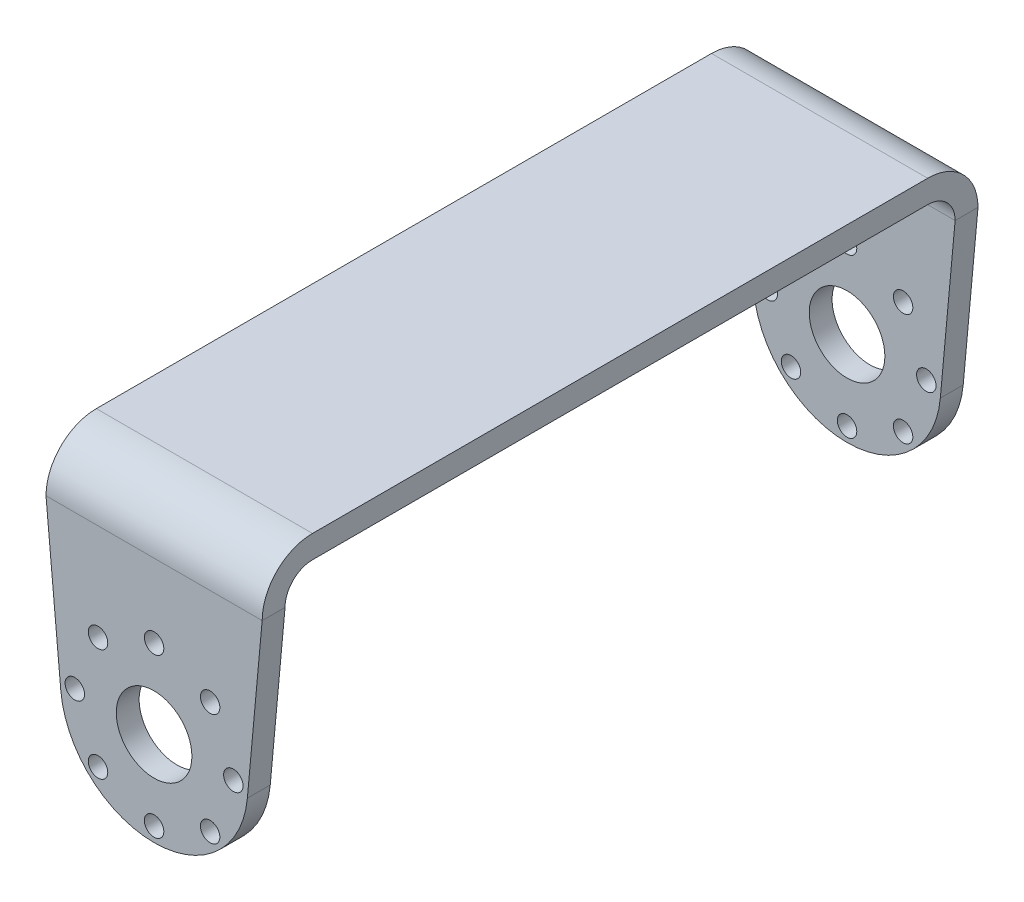
ISO-10303-21;
HEADER;
FILE_DESCRIPTION(('STEP AP214'),'2;1');
FILE_NAME('part.step','',(''),(''),'','','');
FILE_SCHEMA(('AUTOMOTIVE_DESIGN { 1 0 10303 214 1 1 1 1 }'));
ENDSEC;
DATA;
#1=APPLICATION_CONTEXT('core data for automotive mechanical design processes');
#2=APPLICATION_PROTOCOL_DEFINITION('international standard','automotive_design',2000,#1);
#3=PRODUCT_CONTEXT('',#1,'mechanical');
#4=PRODUCT('Part','Part','',(#3));
#5=PRODUCT_RELATED_PRODUCT_CATEGORY('part','',(#4));
#6=PRODUCT_DEFINITION_FORMATION('','',#4);
#7=PRODUCT_DEFINITION_CONTEXT('part definition',#1,'design');
#8=PRODUCT_DEFINITION('design','',#6,#7);
#9=PRODUCT_DEFINITION_SHAPE('','',#8);
#10=(LENGTH_UNIT() NAMED_UNIT(*) SI_UNIT(.MILLI.,.METRE.));
#11=(NAMED_UNIT(*) PLANE_ANGLE_UNIT() SI_UNIT($,.RADIAN.));
#12=(NAMED_UNIT(*) SI_UNIT($,.STERADIAN.) SOLID_ANGLE_UNIT());
#13=UNCERTAINTY_MEASURE_WITH_UNIT(LENGTH_MEASURE(1.E-05),#10,'distance_accuracy_value','');
#14=(GEOMETRIC_REPRESENTATION_CONTEXT(3) GLOBAL_UNCERTAINTY_ASSIGNED_CONTEXT((#13)) GLOBAL_UNIT_ASSIGNED_CONTEXT((#10,
#11,#12)) REPRESENTATION_CONTEXT('',''));
#15=CARTESIAN_POINT('',(0.,0.,0.));
#16=DIRECTION('',(0.,0.,1.));
#17=DIRECTION('',(1.,0.,0.));
#18=AXIS2_PLACEMENT_3D('',#15,#16,#17);
#19=CARTESIAN_POINT('',(0.,1.7241473651667E-13,49.675));
#20=DIRECTION('',(0.,0.,-1.));
#21=DIRECTION('',(0.,1.,0.));
#22=AXIS2_PLACEMENT_3D('',#19,#20,#21);
#23=PLANE('',#22);
#24=CARTESIAN_POINT('',(7.77817459305203,-17.221825406948,49.6750000000001));
#25=DIRECTION('',(0.,0.,1.));
#26=DIRECTION('',(1.,0.,0.));
#27=AXIS2_PLACEMENT_3D('',#24,#25,#26);
#28=CIRCLE('',#27,1.35);
#29=CARTESIAN_POINT('',(9.12817459305203,-17.221825406948,49.6750000000001));
#30=VERTEX_POINT('',#29);
#31=EDGE_CURVE('E194',#30,#30,#28,.T.);
#32=ORIENTED_EDGE('',*,*,#31,.F.);
#33=EDGE_LOOP('',(#32));
#34=FACE_BOUND('',#33,.T.);
#35=CARTESIAN_POINT('',(11.,-25.,49.6750000000001));
#36=DIRECTION('',(0.,0.,1.));
#37=DIRECTION('',(1.,0.,0.));
#38=AXIS2_PLACEMENT_3D('',#35,#36,#37);
#39=CIRCLE('',#38,1.35);
#40=CARTESIAN_POINT('',(12.35,-25.,49.6750000000001));
#41=VERTEX_POINT('',#40);
#42=EDGE_CURVE('E187',#41,#41,#39,.T.);
#43=ORIENTED_EDGE('',*,*,#42,.F.);
#44=EDGE_LOOP('',(#43));
#45=FACE_BOUND('',#44,.T.);
#46=CARTESIAN_POINT('',(7.77817459305203,-32.778174593052,49.6750000000001));
#47=DIRECTION('',(0.,0.,1.));
#48=DIRECTION('',(1.,0.,0.));
#49=AXIS2_PLACEMENT_3D('',#46,#47,#48);
#50=CIRCLE('',#49,1.35);
#51=CARTESIAN_POINT('',(9.12817459305203,-32.778174593052,49.6750000000001));
#52=VERTEX_POINT('',#51);
#53=EDGE_CURVE('E178',#52,#52,#50,.T.);
#54=ORIENTED_EDGE('',*,*,#53,.F.);
#55=EDGE_LOOP('',(#54));
#56=FACE_BOUND('',#55,.T.);
#57=CARTESIAN_POINT('',(0.,-25.,49.6750000000001));
#58=DIRECTION('',(0.,0.,1.));
#59=DIRECTION('',(1.,0.,0.));
#60=AXIS2_PLACEMENT_3D('',#57,#58,#59);
#61=CIRCLE('',#60,5.25);
#62=CARTESIAN_POINT('',(5.25,-25.,49.6750000000001));
#63=VERTEX_POINT('',#62);
#64=EDGE_CURVE('E173',#63,#63,#61,.T.);
#65=ORIENTED_EDGE('',*,*,#64,.F.);
#66=EDGE_LOOP('',(#65));
#67=FACE_BOUND('',#66,.T.);
#68=CARTESIAN_POINT('',(0.,-14.,49.6750000000001));
#69=DIRECTION('',(0.,0.,1.));
#70=DIRECTION('',(1.,0.,0.));
#71=AXIS2_PLACEMENT_3D('',#68,#69,#70);
#72=CIRCLE('',#71,1.35);
#73=CARTESIAN_POINT('',(1.35,-14.,49.6750000000001));
#74=VERTEX_POINT('',#73);
#75=EDGE_CURVE('E203',#74,#74,#72,.T.);
#76=ORIENTED_EDGE('',*,*,#75,.F.);
#77=EDGE_LOOP('',(#76));
#78=FACE_BOUND('',#77,.T.);
#79=CARTESIAN_POINT('',(-7.77817459305202,-17.221825406948,49.6750000000001));
#80=DIRECTION('',(0.,0.,1.));
#81=DIRECTION('',(1.,0.,0.));
#82=AXIS2_PLACEMENT_3D('',#79,#80,#81);
#83=CIRCLE('',#82,1.35);
#84=CARTESIAN_POINT('',(-6.42817459305202,-17.221825406948,49.6750000000001));
#85=VERTEX_POINT('',#84);
#86=EDGE_CURVE('E228',#85,#85,#83,.T.);
#87=ORIENTED_EDGE('',*,*,#86,.F.);
#88=EDGE_LOOP('',(#87));
#89=FACE_BOUND('',#88,.T.);
#90=CARTESIAN_POINT('',(-11.,-25.,49.6750000000001));
#91=DIRECTION('',(0.,0.,1.));
#92=DIRECTION('',(1.,0.,0.));
#93=AXIS2_PLACEMENT_3D('',#90,#91,#92);
#94=CIRCLE('',#93,1.35);
#95=CARTESIAN_POINT('',(-9.65,-25.,49.6750000000001));
#96=VERTEX_POINT('',#95);
#97=EDGE_CURVE('E220',#96,#96,#94,.T.);
#98=ORIENTED_EDGE('',*,*,#97,.F.);
#99=EDGE_LOOP('',(#98));
#100=FACE_BOUND('',#99,.T.);
#101=CARTESIAN_POINT('',(-7.77817459305202,-32.778174593052,49.6750000000001));
#102=DIRECTION('',(0.,0.,1.));
#103=DIRECTION('',(1.,0.,0.));
#104=AXIS2_PLACEMENT_3D('',#101,#102,#103);
#105=CIRCLE('',#104,1.35);
#106=CARTESIAN_POINT('',(-6.42817459305202,-32.778174593052,49.6750000000001));
#107=VERTEX_POINT('',#106);
#108=EDGE_CURVE('E210',#107,#107,#105,.T.);
#109=ORIENTED_EDGE('',*,*,#108,.F.);
#110=EDGE_LOOP('',(#109));
#111=FACE_BOUND('',#110,.T.);
#112=CARTESIAN_POINT('',(0.,-36.,49.6750000000001));
#113=DIRECTION('',(0.,0.,1.));
#114=DIRECTION('',(1.,0.,0.));
#115=AXIS2_PLACEMENT_3D('',#112,#113,#114);
#116=CIRCLE('',#115,1.35);
#117=CARTESIAN_POINT('',(1.35,-36.,49.6750000000001));
#118=VERTEX_POINT('',#117);
#119=EDGE_CURVE('E219',#118,#118,#116,.T.);
#120=ORIENTED_EDGE('',*,*,#119,.F.);
#121=EDGE_LOOP('',(#120));
#122=FACE_BOUND('',#121,.T.);
#123=DIRECTION('',(0.09141984750114,-0.995812437903277,0.));
#124=VECTOR('',#123,1.);
#125=CARTESIAN_POINT('',(-12.9455616927426,-26.1884580175148,49.6750000000001));
#126=LINE('',#125,#124);
#127=CARTESIAN_POINT('',(-15.,-3.80999999999999,49.6750000000001));
#128=VERTEX_POINT('',#127);
#129=CARTESIAN_POINT('',(-12.9455616927426,-26.1884580175148,49.6750000000001));
#130=VERTEX_POINT('',#129);
#131=EDGE_CURVE('E151',#128,#130,#126,.T.);
#132=ORIENTED_EDGE('',*,*,#131,.T.);
#133=CARTESIAN_POINT('',(0.,-25.,49.6750000000001));
#134=DIRECTION('',(0.,0.,1.));
#135=DIRECTION('',(1.,0.,0.));
#136=AXIS2_PLACEMENT_3D('',#133,#134,#135);
#137=CIRCLE('',#136,13.);
#138=CARTESIAN_POINT('',(12.9455616927426,-26.1884580175148,49.6750000000001));
#139=VERTEX_POINT('',#138);
#140=EDGE_CURVE('E134',#130,#139,#137,.T.);
#141=ORIENTED_EDGE('',*,*,#140,.T.);
#142=DIRECTION('',(0.0914198475011396,0.995812437903277,0.));
#143=VECTOR('',#142,1.);
#144=CARTESIAN_POINT('',(12.9455616927426,-26.1884580175148,49.6750000000001));
#145=LINE('',#144,#143);
#146=CARTESIAN_POINT('',(15.,-3.80999999999996,49.6750000000001));
#147=VERTEX_POINT('',#146);
#148=EDGE_CURVE('E143',#139,#147,#145,.T.);
#149=ORIENTED_EDGE('',*,*,#148,.T.);
#150=DIRECTION('',(1.,0.,0.));
#151=VECTOR('',#150,1.);
#152=CARTESIAN_POINT('',(0.,-3.80999999999999,49.675));
#153=LINE('',#152,#151);
#154=EDGE_CURVE('E347',#128,#147,#153,.T.);
#155=ORIENTED_EDGE('',*,*,#154,.F.);
#156=EDGE_LOOP('',(#132,#141,#149,#155));
#157=FACE_BOUND('',#156,.T.);
#158=ADVANCED_FACE('F41',(#34,#45,#56,#67,#78,#89,#100,#111,#122,#157),#23,.F.);
#159=CARTESIAN_POINT('',(0.,1.61329283265843E-13,46.5));
#160=DIRECTION('',(0.,0.,-1.));
#161=DIRECTION('',(0.,1.,0.));
#162=AXIS2_PLACEMENT_3D('',#159,#160,#161);
#163=PLANE('',#162);
#164=CARTESIAN_POINT('',(7.77817459305203,-17.221825406948,46.5000000000001));
#165=DIRECTION('',(0.,0.,-1.));
#166=DIRECTION('',(0.,1.,0.));
#167=AXIS2_PLACEMENT_3D('',#164,#165,#166);
#168=CIRCLE('',#167,1.35);
#169=CARTESIAN_POINT('',(7.77817459305203,-15.871825406948,46.5000000000001));
#170=VERTEX_POINT('',#169);
#171=EDGE_CURVE('E299',#170,#170,#168,.T.);
#172=ORIENTED_EDGE('',*,*,#171,.F.);
#173=EDGE_LOOP('',(#172));
#174=FACE_BOUND('',#173,.T.);
#175=CARTESIAN_POINT('',(11.,-25.,46.5000000000001));
#176=DIRECTION('',(0.,0.,-1.));
#177=DIRECTION('',(0.,1.,0.));
#178=AXIS2_PLACEMENT_3D('',#175,#176,#177);
#179=CIRCLE('',#178,1.35);
#180=CARTESIAN_POINT('',(11.,-23.65,46.5000000000001));
#181=VERTEX_POINT('',#180);
#182=EDGE_CURVE('E295',#181,#181,#179,.T.);
#183=ORIENTED_EDGE('',*,*,#182,.F.);
#184=EDGE_LOOP('',(#183));
#185=FACE_BOUND('',#184,.T.);
#186=CARTESIAN_POINT('',(7.77817459305203,-32.778174593052,46.5000000000001));
#187=DIRECTION('',(0.,0.,-1.));
#188=DIRECTION('',(0.,1.,0.));
#189=AXIS2_PLACEMENT_3D('',#186,#187,#188);
#190=CIRCLE('',#189,1.35);
#191=CARTESIAN_POINT('',(7.77817459305203,-31.428174593052,46.5000000000001));
#192=VERTEX_POINT('',#191);
#193=EDGE_CURVE('E290',#192,#192,#190,.T.);
#194=ORIENTED_EDGE('',*,*,#193,.F.);
#195=EDGE_LOOP('',(#194));
#196=FACE_BOUND('',#195,.T.);
#197=CARTESIAN_POINT('',(0.,-25.,46.5000000000001));
#198=DIRECTION('',(0.,0.,-1.));
#199=DIRECTION('',(0.,1.,0.));
#200=AXIS2_PLACEMENT_3D('',#197,#198,#199);
#201=CIRCLE('',#200,5.25);
#202=CARTESIAN_POINT('',(0.,-19.75,46.5000000000001));
#203=VERTEX_POINT('',#202);
#204=EDGE_CURVE('E285',#203,#203,#201,.T.);
#205=ORIENTED_EDGE('',*,*,#204,.F.);
#206=EDGE_LOOP('',(#205));
#207=FACE_BOUND('',#206,.T.);
#208=CARTESIAN_POINT('',(0.,-14.,46.5000000000001));
#209=DIRECTION('',(0.,0.,-1.));
#210=DIRECTION('',(0.,1.,0.));
#211=AXIS2_PLACEMENT_3D('',#208,#209,#210);
#212=CIRCLE('',#211,1.35);
#213=CARTESIAN_POINT('',(0.,-12.65,46.5000000000001));
#214=VERTEX_POINT('',#213);
#215=EDGE_CURVE('E280',#214,#214,#212,.T.);
#216=ORIENTED_EDGE('',*,*,#215,.F.);
#217=EDGE_LOOP('',(#216));
#218=FACE_BOUND('',#217,.T.);
#219=CARTESIAN_POINT('',(-7.77817459305202,-17.221825406948,46.5000000000001));
#220=DIRECTION('',(0.,0.,-1.));
#221=DIRECTION('',(0.,1.,0.));
#222=AXIS2_PLACEMENT_3D('',#219,#220,#221);
#223=CIRCLE('',#222,1.35);
#224=CARTESIAN_POINT('',(-7.77817459305202,-15.871825406948,46.5000000000001));
#225=VERTEX_POINT('',#224);
#226=EDGE_CURVE('E276',#225,#225,#223,.T.);
#227=ORIENTED_EDGE('',*,*,#226,.F.);
#228=EDGE_LOOP('',(#227));
#229=FACE_BOUND('',#228,.T.);
#230=CARTESIAN_POINT('',(-11.,-25.,46.5000000000001));
#231=DIRECTION('',(0.,0.,-1.));
#232=DIRECTION('',(0.,1.,0.));
#233=AXIS2_PLACEMENT_3D('',#230,#231,#232);
#234=CIRCLE('',#233,1.35);
#235=CARTESIAN_POINT('',(-11.,-23.65,46.5000000000001));
#236=VERTEX_POINT('',#235);
#237=EDGE_CURVE('E271',#236,#236,#234,.T.);
#238=ORIENTED_EDGE('',*,*,#237,.F.);
#239=EDGE_LOOP('',(#238));
#240=FACE_BOUND('',#239,.T.);
#241=CARTESIAN_POINT('',(-7.77817459305202,-32.778174593052,46.5000000000001));
#242=DIRECTION('',(0.,0.,-1.));
#243=DIRECTION('',(0.,1.,0.));
#244=AXIS2_PLACEMENT_3D('',#241,#242,#243);
#245=CIRCLE('',#244,1.35);
#246=CARTESIAN_POINT('',(-7.77817459305202,-31.428174593052,46.5000000000001));
#247=VERTEX_POINT('',#246);
#248=EDGE_CURVE('E266',#247,#247,#245,.T.);
#249=ORIENTED_EDGE('',*,*,#248,.F.);
#250=EDGE_LOOP('',(#249));
#251=FACE_BOUND('',#250,.T.);
#252=CARTESIAN_POINT('',(0.,-36.,46.5000000000001));
#253=DIRECTION('',(0.,0.,-1.));
#254=DIRECTION('',(0.,1.,0.));
#255=AXIS2_PLACEMENT_3D('',#252,#253,#254);
#256=CIRCLE('',#255,1.35);
#257=CARTESIAN_POINT('',(0.,-34.65,46.5000000000001));
#258=VERTEX_POINT('',#257);
#259=EDGE_CURVE('E254',#258,#258,#256,.T.);
#260=ORIENTED_EDGE('',*,*,#259,.F.);
#261=EDGE_LOOP('',(#260));
#262=FACE_BOUND('',#261,.T.);
#263=CARTESIAN_POINT('',(0.,-25.,46.5000000000001));
#264=DIRECTION('',(0.,0.,-1.));
#265=DIRECTION('',(0.,1.,0.));
#266=AXIS2_PLACEMENT_3D('',#263,#264,#265);
#267=CIRCLE('',#266,13.);
#268=CARTESIAN_POINT('',(12.9455616927426,-26.1884580175148,46.5000000000001));
#269=VERTEX_POINT('',#268);
#270=CARTESIAN_POINT('',(-12.9455616927426,-26.1884580175148,46.5000000000001));
#271=VERTEX_POINT('',#270);
#272=EDGE_CURVE('E136',#269,#271,#267,.T.);
#273=ORIENTED_EDGE('',*,*,#272,.T.);
#274=DIRECTION('',(-0.09141984750114,0.995812437903277,0.));
#275=VECTOR('',#274,1.);
#276=CARTESIAN_POINT('',(-15.221487223064,-1.39739773044295,46.5));
#277=LINE('',#276,#275);
#278=CARTESIAN_POINT('',(-15.,-3.80999999999999,46.5000000000001));
#279=VERTEX_POINT('',#278);
#280=EDGE_CURVE('E261',#271,#279,#277,.T.);
#281=ORIENTED_EDGE('',*,*,#280,.T.);
#282=DIRECTION('',(-1.,0.,0.));
#283=VECTOR('',#282,1.);
#284=CARTESIAN_POINT('',(15.,-3.80999999999999,46.5));
#285=LINE('',#284,#283);
#286=CARTESIAN_POINT('',(15.,-3.80999999999996,46.5000000000001));
#287=VERTEX_POINT('',#286);
#288=EDGE_CURVE('E339',#287,#279,#285,.T.);
#289=ORIENTED_EDGE('',*,*,#288,.F.);
#290=DIRECTION('',(-0.0914198475011396,-0.995812437903277,0.));
#291=VECTOR('',#290,1.);
#292=CARTESIAN_POINT('',(15.221487223064,-1.39739773044294,46.5));
#293=LINE('',#292,#291);
#294=EDGE_CURVE('E258',#287,#269,#293,.T.);
#295=ORIENTED_EDGE('',*,*,#294,.T.);
#296=EDGE_LOOP('',(#273,#281,#289,#295));
#297=FACE_BOUND('',#296,.T.);
#298=ADVANCED_FACE('F483',(#174,#185,#196,#207,#218,#229,#240,#251,#262,#297),#163,.T.);
#299=CARTESIAN_POINT('',(0.,1.7241473651667E-13,-49.675));
#300=DIRECTION('',(0.,0.,1.));
#301=DIRECTION('',(0.,-1.,0.));
#302=AXIS2_PLACEMENT_3D('',#299,#300,#301);
#303=PLANE('',#302);
#304=CARTESIAN_POINT('',(7.77817459305203,-17.221825406948,-49.6750000000001));
#305=DIRECTION('',(0.,0.,1.));
#306=DIRECTION('',(1.,0.,0.));
#307=AXIS2_PLACEMENT_3D('',#304,#305,#306);
#308=CIRCLE('',#307,1.35);
#309=CARTESIAN_POINT('',(9.12817459305203,-17.221825406948,-49.6750000000001));
#310=VERTEX_POINT('',#309);
#311=EDGE_CURVE('E198',#310,#310,#308,.T.);
#312=ORIENTED_EDGE('',*,*,#311,.T.);
#313=EDGE_LOOP('',(#312));
#314=FACE_BOUND('',#313,.T.);
#315=CARTESIAN_POINT('',(11.,-25.,-49.6750000000001));
#316=DIRECTION('',(0.,0.,1.));
#317=DIRECTION('',(1.,0.,0.));
#318=AXIS2_PLACEMENT_3D('',#315,#316,#317);
#319=CIRCLE('',#318,1.35);
#320=CARTESIAN_POINT('',(12.35,-25.,-49.6750000000001));
#321=VERTEX_POINT('',#320);
#322=EDGE_CURVE('E199',#321,#321,#319,.T.);
#323=ORIENTED_EDGE('',*,*,#322,.T.);
#324=EDGE_LOOP('',(#323));
#325=FACE_BOUND('',#324,.T.);
#326=CARTESIAN_POINT('',(7.77817459305203,-32.778174593052,-49.6750000000001));
#327=DIRECTION('',(0.,0.,1.));
#328=DIRECTION('',(1.,0.,0.));
#329=AXIS2_PLACEMENT_3D('',#326,#327,#328);
#330=CIRCLE('',#329,1.35);
#331=CARTESIAN_POINT('',(9.12817459305203,-32.778174593052,-49.6750000000001));
#332=VERTEX_POINT('',#331);
#333=EDGE_CURVE('E182',#332,#332,#330,.T.);
#334=ORIENTED_EDGE('',*,*,#333,.T.);
#335=EDGE_LOOP('',(#334));
#336=FACE_BOUND('',#335,.T.);
#337=CARTESIAN_POINT('',(0.,-25.,-49.6750000000001));
#338=DIRECTION('',(0.,0.,1.));
#339=DIRECTION('',(1.,0.,0.));
#340=AXIS2_PLACEMENT_3D('',#337,#338,#339);
#341=CIRCLE('',#340,5.25);
#342=CARTESIAN_POINT('',(5.25,-25.,-49.6750000000001));
#343=VERTEX_POINT('',#342);
#344=EDGE_CURVE('E183',#343,#343,#341,.T.);
#345=ORIENTED_EDGE('',*,*,#344,.T.);
#346=EDGE_LOOP('',(#345));
#347=FACE_BOUND('',#346,.T.);
#348=CARTESIAN_POINT('',(0.,-14.,-49.6750000000001));
#349=DIRECTION('',(0.,0.,1.));
#350=DIRECTION('',(1.,0.,0.));
#351=AXIS2_PLACEMENT_3D('',#348,#349,#350);
#352=CIRCLE('',#351,1.35);
#353=CARTESIAN_POINT('',(1.35,-14.,-49.6750000000001));
#354=VERTEX_POINT('',#353);
#355=EDGE_CURVE('E232',#354,#354,#352,.T.);
#356=ORIENTED_EDGE('',*,*,#355,.T.);
#357=EDGE_LOOP('',(#356));
#358=FACE_BOUND('',#357,.T.);
#359=CARTESIAN_POINT('',(-7.77817459305202,-17.221825406948,-49.6750000000001));
#360=DIRECTION('',(0.,0.,1.));
#361=DIRECTION('',(1.,0.,0.));
#362=AXIS2_PLACEMENT_3D('',#359,#360,#361);
#363=CIRCLE('',#362,1.35);
#364=CARTESIAN_POINT('',(-6.42817459305202,-17.221825406948,-49.6750000000001));
#365=VERTEX_POINT('',#364);
#366=EDGE_CURVE('E224',#365,#365,#363,.T.);
#367=ORIENTED_EDGE('',*,*,#366,.T.);
#368=EDGE_LOOP('',(#367));
#369=FACE_BOUND('',#368,.T.);
#370=CARTESIAN_POINT('',(-11.,-25.,-49.6750000000001));
#371=DIRECTION('',(0.,0.,1.));
#372=DIRECTION('',(1.,0.,0.));
#373=AXIS2_PLACEMENT_3D('',#370,#371,#372);
#374=CIRCLE('',#373,1.35);
#375=CARTESIAN_POINT('',(-9.65,-25.,-49.6750000000001));
#376=VERTEX_POINT('',#375);
#377=EDGE_CURVE('E215',#376,#376,#374,.T.);
#378=ORIENTED_EDGE('',*,*,#377,.T.);
#379=EDGE_LOOP('',(#378));
#380=FACE_BOUND('',#379,.T.);
#381=CARTESIAN_POINT('',(-7.77817459305202,-32.778174593052,-49.6750000000001));
#382=DIRECTION('',(0.,0.,1.));
#383=DIRECTION('',(1.,0.,0.));
#384=AXIS2_PLACEMENT_3D('',#381,#382,#383);
#385=CIRCLE('',#384,1.35);
#386=CARTESIAN_POINT('',(-6.42817459305202,-32.778174593052,-49.6750000000001));
#387=VERTEX_POINT('',#386);
#388=EDGE_CURVE('E214',#387,#387,#385,.T.);
#389=ORIENTED_EDGE('',*,*,#388,.T.);
#390=EDGE_LOOP('',(#389));
#391=FACE_BOUND('',#390,.T.);
#392=CARTESIAN_POINT('',(0.,-36.,-49.6750000000001));
#393=DIRECTION('',(0.,0.,1.));
#394=DIRECTION('',(1.,0.,0.));
#395=AXIS2_PLACEMENT_3D('',#392,#393,#394);
#396=CIRCLE('',#395,1.35);
#397=CARTESIAN_POINT('',(1.35,-36.,-49.6750000000001));
#398=VERTEX_POINT('',#397);
#399=EDGE_CURVE('E244',#398,#398,#396,.T.);
#400=ORIENTED_EDGE('',*,*,#399,.T.);
#401=EDGE_LOOP('',(#400));
#402=FACE_BOUND('',#401,.T.);
#403=DIRECTION('',(0.09141984750114,-0.995812437903277,0.));
#404=VECTOR('',#403,1.);
#405=CARTESIAN_POINT('',(-12.9455616927426,-26.1884580175148,-49.6750000000001));
#406=LINE('',#405,#404);
#407=CARTESIAN_POINT('',(-15.,-3.80999999999999,-49.6750000000001));
#408=VERTEX_POINT('',#407);
#409=CARTESIAN_POINT('',(-12.9455616927426,-26.1884580175148,-49.6750000000001));
#410=VERTEX_POINT('',#409);
#411=EDGE_CURVE('E140',#408,#410,#406,.T.);
#412=ORIENTED_EDGE('',*,*,#411,.F.);
#413=DIRECTION('',(-1.,0.,0.));
#414=VECTOR('',#413,1.);
#415=CARTESIAN_POINT('',(0.,-3.80999999999996,-49.675));
#416=LINE('',#415,#414);
#417=CARTESIAN_POINT('',(15.,-3.80999999999996,-49.6750000000001));
#418=VERTEX_POINT('',#417);
#419=EDGE_CURVE('E312',#418,#408,#416,.T.);
#420=ORIENTED_EDGE('',*,*,#419,.F.);
#421=DIRECTION('',(0.0914198475011396,0.995812437903277,0.));
#422=VECTOR('',#421,1.);
#423=CARTESIAN_POINT('',(12.9455616927426,-26.1884580175148,-49.6750000000001));
#424=LINE('',#423,#422);
#425=CARTESIAN_POINT('',(12.9455616927426,-26.1884580175148,-49.6750000000001));
#426=VERTEX_POINT('',#425);
#427=EDGE_CURVE('E164',#426,#418,#424,.T.);
#428=ORIENTED_EDGE('',*,*,#427,.F.);
#429=CARTESIAN_POINT('',(0.,-25.,-49.6750000000001));
#430=DIRECTION('',(0.,0.,1.));
#431=DIRECTION('',(1.,0.,0.));
#432=AXIS2_PLACEMENT_3D('',#429,#430,#431);
#433=CIRCLE('',#432,13.);
#434=EDGE_CURVE('E161',#410,#426,#433,.T.);
#435=ORIENTED_EDGE('',*,*,#434,.F.);
#436=EDGE_LOOP('',(#412,#420,#428,#435));
#437=FACE_BOUND('',#436,.T.);
#438=ADVANCED_FACE('F420',(#314,#325,#336,#347,#358,#369,#380,#391,#402,#437),#303,.F.);
#439=CARTESIAN_POINT('',(0.,1.61329283265843E-13,-46.5));
#440=DIRECTION('',(0.,0.,1.));
#441=DIRECTION('',(0.,-1.,0.));
#442=AXIS2_PLACEMENT_3D('',#439,#440,#441);
#443=PLANE('',#442);
#444=CARTESIAN_POINT('',(7.77817459305203,-17.221825406948,-46.5));
#445=DIRECTION('',(0.,0.,1.));
#446=DIRECTION('',(0.,-1.,0.));
#447=AXIS2_PLACEMENT_3D('',#444,#445,#446);
#448=CIRCLE('',#447,1.35);
#449=CARTESIAN_POINT('',(7.77817459305203,-18.571825406948,-46.5000000000001));
#450=VERTEX_POINT('',#449);
#451=EDGE_CURVE('E45',#450,#450,#448,.T.);
#452=ORIENTED_EDGE('',*,*,#451,.F.);
#453=EDGE_LOOP('',(#452));
#454=FACE_BOUND('',#453,.T.);
#455=CARTESIAN_POINT('',(11.,-25.,-46.5000000000001));
#456=DIRECTION('',(0.,0.,1.));
#457=DIRECTION('',(0.,-1.,0.));
#458=AXIS2_PLACEMENT_3D('',#455,#456,#457);
#459=CIRCLE('',#458,1.35);
#460=CARTESIAN_POINT('',(11.,-26.35,-46.5000000000001));
#461=VERTEX_POINT('',#460);
#462=EDGE_CURVE('E294',#461,#461,#459,.T.);
#463=ORIENTED_EDGE('',*,*,#462,.F.);
#464=EDGE_LOOP('',(#463));
#465=FACE_BOUND('',#464,.T.);
#466=CARTESIAN_POINT('',(7.77817459305203,-32.778174593052,-46.5000000000001));
#467=DIRECTION('',(0.,0.,1.));
#468=DIRECTION('',(0.,-1.,0.));
#469=AXIS2_PLACEMENT_3D('',#466,#467,#468);
#470=CIRCLE('',#469,1.35);
#471=CARTESIAN_POINT('',(7.77817459305203,-34.128174593052,-46.5000000000001));
#472=VERTEX_POINT('',#471);
#473=EDGE_CURVE('E289',#472,#472,#470,.T.);
#474=ORIENTED_EDGE('',*,*,#473,.F.);
#475=EDGE_LOOP('',(#474));
#476=FACE_BOUND('',#475,.T.);
#477=CARTESIAN_POINT('',(0.,-25.,-46.5000000000001));
#478=DIRECTION('',(0.,0.,1.));
#479=DIRECTION('',(0.,-1.,0.));
#480=AXIS2_PLACEMENT_3D('',#477,#478,#479);
#481=CIRCLE('',#480,5.25);
#482=CARTESIAN_POINT('',(0.,-30.25,-46.5000000000001));
#483=VERTEX_POINT('',#482);
#484=EDGE_CURVE('E284',#483,#483,#481,.T.);
#485=ORIENTED_EDGE('',*,*,#484,.F.);
#486=EDGE_LOOP('',(#485));
#487=FACE_BOUND('',#486,.T.);
#488=CARTESIAN_POINT('',(0.,-14.,-46.5));
#489=DIRECTION('',(0.,0.,1.));
#490=DIRECTION('',(0.,-1.,0.));
#491=AXIS2_PLACEMENT_3D('',#488,#489,#490);
#492=CIRCLE('',#491,1.35);
#493=CARTESIAN_POINT('',(0.,-15.35,-46.5));
#494=VERTEX_POINT('',#493);
#495=EDGE_CURVE('E279',#494,#494,#492,.T.);
#496=ORIENTED_EDGE('',*,*,#495,.F.);
#497=EDGE_LOOP('',(#496));
#498=FACE_BOUND('',#497,.T.);
#499=CARTESIAN_POINT('',(-7.77817459305202,-17.221825406948,-46.5));
#500=DIRECTION('',(0.,0.,1.));
#501=DIRECTION('',(0.,-1.,0.));
#502=AXIS2_PLACEMENT_3D('',#499,#500,#501);
#503=CIRCLE('',#502,1.35);
#504=CARTESIAN_POINT('',(-7.77817459305202,-18.571825406948,-46.5000000000001));
#505=VERTEX_POINT('',#504);
#506=EDGE_CURVE('E275',#505,#505,#503,.T.);
#507=ORIENTED_EDGE('',*,*,#506,.F.);
#508=EDGE_LOOP('',(#507));
#509=FACE_BOUND('',#508,.T.);
#510=CARTESIAN_POINT('',(-11.,-25.,-46.5000000000001));
#511=DIRECTION('',(0.,0.,1.));
#512=DIRECTION('',(0.,-1.,0.));
#513=AXIS2_PLACEMENT_3D('',#510,#511,#512);
#514=CIRCLE('',#513,1.35);
#515=CARTESIAN_POINT('',(-11.,-26.35,-46.5000000000001));
#516=VERTEX_POINT('',#515);
#517=EDGE_CURVE('E270',#516,#516,#514,.T.);
#518=ORIENTED_EDGE('',*,*,#517,.F.);
#519=EDGE_LOOP('',(#518));
#520=FACE_BOUND('',#519,.T.);
#521=CARTESIAN_POINT('',(-7.77817459305202,-32.778174593052,-46.5000000000001));
#522=DIRECTION('',(0.,0.,1.));
#523=DIRECTION('',(0.,-1.,0.));
#524=AXIS2_PLACEMENT_3D('',#521,#522,#523);
#525=CIRCLE('',#524,1.35);
#526=CARTESIAN_POINT('',(-7.77817459305202,-34.128174593052,-46.5000000000001));
#527=VERTEX_POINT('',#526);
#528=EDGE_CURVE('E265',#527,#527,#525,.T.);
#529=ORIENTED_EDGE('',*,*,#528,.F.);
#530=EDGE_LOOP('',(#529));
#531=FACE_BOUND('',#530,.T.);
#532=CARTESIAN_POINT('',(0.,-36.,-46.5000000000001));
#533=DIRECTION('',(0.,0.,1.));
#534=DIRECTION('',(0.,-1.,0.));
#535=AXIS2_PLACEMENT_3D('',#532,#533,#534);
#536=CIRCLE('',#535,1.35);
#537=CARTESIAN_POINT('',(0.,-37.35,-46.5000000000001));
#538=VERTEX_POINT('',#537);
#539=EDGE_CURVE('E253',#538,#538,#536,.T.);
#540=ORIENTED_EDGE('',*,*,#539,.F.);
#541=EDGE_LOOP('',(#540));
#542=FACE_BOUND('',#541,.T.);
#543=DIRECTION('',(1.,0.,0.));
#544=VECTOR('',#543,1.);
#545=CARTESIAN_POINT('',(-15.,-3.80999999999999,-46.5));
#546=LINE('',#545,#544);
#547=CARTESIAN_POINT('',(-15.,-3.80999999999999,-46.5));
#548=VERTEX_POINT('',#547);
#549=CARTESIAN_POINT('',(15.,-3.81,-46.5));
#550=VERTEX_POINT('',#549);
#551=EDGE_CURVE('E304',#548,#550,#546,.T.);
#552=ORIENTED_EDGE('',*,*,#551,.F.);
#553=DIRECTION('',(0.09141984750114,-0.995812437903277,0.));
#554=VECTOR('',#553,1.);
#555=CARTESIAN_POINT('',(-15.221487223064,-1.39739773044295,-46.5));
#556=LINE('',#555,#554);
#557=CARTESIAN_POINT('',(-12.9455616927426,-26.1884580175148,-46.5));
#558=VERTEX_POINT('',#557);
#559=EDGE_CURVE('E12',#548,#558,#556,.T.);
#560=ORIENTED_EDGE('',*,*,#559,.T.);
#561=CARTESIAN_POINT('',(0.,-25.,-46.5000000000001));
#562=DIRECTION('',(0.,0.,1.));
#563=DIRECTION('',(0.,-1.,0.));
#564=AXIS2_PLACEMENT_3D('',#561,#562,#563);
#565=CIRCLE('',#564,13.);
#566=CARTESIAN_POINT('',(12.9455616927426,-26.1884580175148,-46.5));
#567=VERTEX_POINT('',#566);
#568=EDGE_CURVE('E248',#558,#567,#565,.T.);
#569=ORIENTED_EDGE('',*,*,#568,.T.);
#570=DIRECTION('',(0.0914198475011396,0.995812437903277,0.));
#571=VECTOR('',#570,1.);
#572=CARTESIAN_POINT('',(15.221487223064,-1.39739773044294,-46.5));
#573=LINE('',#572,#571);
#574=EDGE_CURVE('E51',#567,#550,#573,.T.);
#575=ORIENTED_EDGE('',*,*,#574,.T.);
#576=EDGE_LOOP('',(#552,#560,#569,#575));
#577=FACE_BOUND('',#576,.T.);
#578=ADVANCED_FACE('F417',(#454,#465,#476,#487,#498,#509,#520,#531,#542,#577),#443,.T.);
#579=CARTESIAN_POINT('',(15.,3.175,46.5));
#580=DIRECTION('',(-1.,0.,0.));
#581=DIRECTION('',(0.,0.,1.));
#582=AXIS2_PLACEMENT_3D('',#579,#580,#581);
#583=PLANE('',#582);
#584=DIRECTION('',(0.,0.,-1.));
#585=VECTOR('',#584,1.);
#586=CARTESIAN_POINT('',(15.,0.,46.5));
#587=LINE('',#586,#585);
#588=CARTESIAN_POINT('',(15.,0.,42.69));
#589=VERTEX_POINT('',#588);
#590=CARTESIAN_POINT('',(15.,0.,-42.69));
#591=VERTEX_POINT('',#590);
#592=EDGE_CURVE('E361',#589,#591,#587,.T.);
#593=ORIENTED_EDGE('',*,*,#592,.T.);
#594=CARTESIAN_POINT('',(15.,-3.81000000000001,-42.69));
#595=DIRECTION('',(1.,0.,0.));
#596=DIRECTION('',(0.,0.,-1.));
#597=AXIS2_PLACEMENT_3D('',#594,#595,#596);
#598=CIRCLE('',#597,3.81);
#599=EDGE_CURVE('E318',#550,#591,#598,.T.);
#600=ORIENTED_EDGE('',*,*,#599,.F.);
#601=DIRECTION('',(0.,0.,-1.));
#602=VECTOR('',#601,1.);
#603=CARTESIAN_POINT('',(15.,-3.80999999999999,-46.5));
#604=LINE('',#603,#602);
#605=EDGE_CURVE('E308',#550,#418,#604,.T.);
#606=ORIENTED_EDGE('',*,*,#605,.T.);
#607=CARTESIAN_POINT('',(15.,-3.81000000000001,-42.69));
#608=DIRECTION('',(1.,0.,0.));
#609=DIRECTION('',(0.,0.,-1.));
#610=AXIS2_PLACEMENT_3D('',#607,#608,#609);
#611=CIRCLE('',#610,6.985);
#612=CARTESIAN_POINT('',(15.,3.17499999999999,-42.69));
#613=VERTEX_POINT('',#612);
#614=EDGE_CURVE('E323',#418,#613,#611,.T.);
#615=ORIENTED_EDGE('',*,*,#614,.T.);
#616=DIRECTION('',(0.,0.,-1.));
#617=VECTOR('',#616,1.);
#618=CARTESIAN_POINT('',(15.,3.175,46.5));
#619=LINE('',#618,#617);
#620=CARTESIAN_POINT('',(15.,3.175,42.69));
#621=VERTEX_POINT('',#620);
#622=EDGE_CURVE('E376',#621,#613,#619,.T.);
#623=ORIENTED_EDGE('',*,*,#622,.F.);
#624=CARTESIAN_POINT('',(15.,-3.80999999999999,42.69));
#625=DIRECTION('',(-1.,0.,0.));
#626=DIRECTION('',(0.,0.,1.));
#627=AXIS2_PLACEMENT_3D('',#624,#625,#626);
#628=CIRCLE('',#627,6.985);
#629=EDGE_CURVE('E356',#621,#147,#628,.F.);
#630=ORIENTED_EDGE('',*,*,#629,.T.);
#631=DIRECTION('',(0.,0.,1.));
#632=VECTOR('',#631,1.);
#633=CARTESIAN_POINT('',(15.,-3.80999999999999,46.5));
#634=LINE('',#633,#632);
#635=EDGE_CURVE('E146',#287,#147,#634,.T.);
#636=ORIENTED_EDGE('',*,*,#635,.F.);
#637=CARTESIAN_POINT('',(15.,-3.80999999999999,42.69));
#638=DIRECTION('',(-1.,0.,0.));
#639=DIRECTION('',(0.,0.,1.));
#640=AXIS2_PLACEMENT_3D('',#637,#638,#639);
#641=CIRCLE('',#640,3.81);
#642=EDGE_CURVE('E365',#589,#287,#641,.F.);
#643=ORIENTED_EDGE('',*,*,#642,.F.);
#644=EDGE_LOOP('',(#593,#600,#606,#615,#623,#630,#636,#643));
#645=FACE_BOUND('',#644,.T.);
#646=ADVANCED_FACE('F43',(#645),#583,.F.);
#647=CARTESIAN_POINT('',(-15.,3.175,46.5));
#648=DIRECTION('',(1.,0.,0.));
#649=DIRECTION('',(0.,0.,-1.));
#650=AXIS2_PLACEMENT_3D('',#647,#648,#649);
#651=PLANE('',#650);
#652=DIRECTION('',(0.,0.,1.));
#653=VECTOR('',#652,1.);
#654=CARTESIAN_POINT('',(-15.,3.175,46.5));
#655=LINE('',#654,#653);
#656=CARTESIAN_POINT('',(-15.,3.175,-42.69));
#657=VERTEX_POINT('',#656);
#658=CARTESIAN_POINT('',(-15.,3.17500000000001,42.69));
#659=VERTEX_POINT('',#658);
#660=EDGE_CURVE('E379',#657,#659,#655,.T.);
#661=ORIENTED_EDGE('',*,*,#660,.F.);
#662=CARTESIAN_POINT('',(-15.,-3.81000000000001,-42.69));
#663=DIRECTION('',(1.,0.,0.));
#664=DIRECTION('',(0.,0.,-1.));
#665=AXIS2_PLACEMENT_3D('',#662,#663,#664);
#666=CIRCLE('',#665,6.985);
#667=EDGE_CURVE('E322',#657,#408,#666,.F.);
#668=ORIENTED_EDGE('',*,*,#667,.T.);
#669=DIRECTION('',(0.,0.,-1.));
#670=VECTOR('',#669,1.);
#671=CARTESIAN_POINT('',(-15.,-3.80999999999999,-46.5));
#672=LINE('',#671,#670);
#673=EDGE_CURVE('E303',#548,#408,#672,.T.);
#674=ORIENTED_EDGE('',*,*,#673,.F.);
#675=CARTESIAN_POINT('',(-15.,-3.81000000000001,-42.69));
#676=DIRECTION('',(1.,0.,0.));
#677=DIRECTION('',(0.,0.,-1.));
#678=AXIS2_PLACEMENT_3D('',#675,#676,#677);
#679=CIRCLE('',#678,3.81);
#680=CARTESIAN_POINT('',(-15.,0.,-42.69));
#681=VERTEX_POINT('',#680);
#682=EDGE_CURVE('E330',#681,#548,#679,.F.);
#683=ORIENTED_EDGE('',*,*,#682,.F.);
#684=DIRECTION('',(0.,0.,1.));
#685=VECTOR('',#684,1.);
#686=CARTESIAN_POINT('',(-15.,0.,46.5));
#687=LINE('',#686,#685);
#688=CARTESIAN_POINT('',(-15.,0.,42.69));
#689=VERTEX_POINT('',#688);
#690=EDGE_CURVE('E380',#681,#689,#687,.T.);
#691=ORIENTED_EDGE('',*,*,#690,.T.);
#692=CARTESIAN_POINT('',(-15.,-3.80999999999999,42.69));
#693=DIRECTION('',(-1.,0.,0.));
#694=DIRECTION('',(0.,0.,1.));
#695=AXIS2_PLACEMENT_3D('',#692,#693,#694);
#696=CIRCLE('',#695,3.81);
#697=EDGE_CURVE('E352',#279,#689,#696,.T.);
#698=ORIENTED_EDGE('',*,*,#697,.F.);
#699=DIRECTION('',(0.,0.,1.));
#700=VECTOR('',#699,1.);
#701=CARTESIAN_POINT('',(-15.,-3.80999999999999,46.5));
#702=LINE('',#701,#700);
#703=EDGE_CURVE('E343',#279,#128,#702,.T.);
#704=ORIENTED_EDGE('',*,*,#703,.T.);
#705=CARTESIAN_POINT('',(-15.,-3.80999999999999,42.69));
#706=DIRECTION('',(-1.,0.,0.));
#707=DIRECTION('',(0.,0.,1.));
#708=AXIS2_PLACEMENT_3D('',#705,#706,#707);
#709=CIRCLE('',#708,6.985);
#710=EDGE_CURVE('E357',#128,#659,#709,.T.);
#711=ORIENTED_EDGE('',*,*,#710,.T.);
#712=EDGE_LOOP('',(#661,#668,#674,#683,#691,#698,#704,#711));
#713=FACE_BOUND('',#712,.T.);
#714=ADVANCED_FACE('F454',(#713),#651,.F.);
#715=CARTESIAN_POINT('',(0.,3.175,0.));
#716=DIRECTION('',(0.,-1.,0.));
#717=DIRECTION('',(0.,0.,-1.));
#718=AXIS2_PLACEMENT_3D('',#715,#716,#717);
#719=PLANE('',#718);
#720=DIRECTION('',(1.,0.,0.));
#721=VECTOR('',#720,1.);
#722=CARTESIAN_POINT('',(15.,3.17499999999999,-42.69));
#723=LINE('',#722,#721);
#724=EDGE_CURVE('E319',#613,#657,#723,.F.);
#725=ORIENTED_EDGE('',*,*,#724,.T.);
#726=ORIENTED_EDGE('',*,*,#660,.T.);
#727=DIRECTION('',(-1.,0.,0.));
#728=VECTOR('',#727,1.);
#729=CARTESIAN_POINT('',(-15.,3.17500000000001,42.69));
#730=LINE('',#729,#728);
#731=EDGE_CURVE('E353',#659,#621,#730,.F.);
#732=ORIENTED_EDGE('',*,*,#731,.T.);
#733=ORIENTED_EDGE('',*,*,#622,.T.);
#734=EDGE_LOOP('',(#725,#726,#732,#733));
#735=FACE_BOUND('',#734,.T.);
#736=ADVANCED_FACE('F474',(#735),#719,.F.);
#737=CARTESIAN_POINT('',(0.,0.,0.));
#738=DIRECTION('',(0.,-1.,0.));
#739=DIRECTION('',(0.,0.,-1.));
#740=AXIS2_PLACEMENT_3D('',#737,#738,#739);
#741=PLANE('',#740);
#742=ORIENTED_EDGE('',*,*,#690,.F.);
#743=DIRECTION('',(1.,0.,0.));
#744=VECTOR('',#743,1.);
#745=CARTESIAN_POINT('',(15.,0.,-42.69));
#746=LINE('',#745,#744);
#747=EDGE_CURVE('E67',#591,#681,#746,.F.);
#748=ORIENTED_EDGE('',*,*,#747,.F.);
#749=ORIENTED_EDGE('',*,*,#592,.F.);
#750=DIRECTION('',(-1.,0.,0.));
#751=VECTOR('',#750,1.);
#752=CARTESIAN_POINT('',(-15.,0.,42.69));
#753=LINE('',#752,#751);
#754=EDGE_CURVE('E369',#689,#589,#753,.F.);
#755=ORIENTED_EDGE('',*,*,#754,.F.);
#756=EDGE_LOOP('',(#742,#748,#749,#755));
#757=FACE_BOUND('',#756,.T.);
#758=ADVANCED_FACE('F447',(#757),#741,.T.);
#759=CARTESIAN_POINT('',(-15.,-3.80999999999999,42.69));
#760=DIRECTION('',(-1.,0.,0.));
#761=DIRECTION('',(0.,0.,1.));
#762=AXIS2_PLACEMENT_3D('',#759,#760,#761);
#763=CYLINDRICAL_SURFACE('',#762,6.985);
#764=ORIENTED_EDGE('',*,*,#731,.F.);
#765=ORIENTED_EDGE('',*,*,#710,.F.);
#766=ORIENTED_EDGE('',*,*,#154,.T.);
#767=ORIENTED_EDGE('',*,*,#629,.F.);
#768=EDGE_LOOP('',(#764,#765,#766,#767));
#769=FACE_BOUND('',#768,.T.);
#770=ADVANCED_FACE('F472',(#769),#763,.T.);
#771=CARTESIAN_POINT('',(-15.,-3.80999999999999,42.69));
#772=DIRECTION('',(-1.,0.,0.));
#773=DIRECTION('',(0.,0.,1.));
#774=AXIS2_PLACEMENT_3D('',#771,#772,#773);
#775=CYLINDRICAL_SURFACE('',#774,3.81);
#776=ORIENTED_EDGE('',*,*,#754,.T.);
#777=ORIENTED_EDGE('',*,*,#642,.T.);
#778=ORIENTED_EDGE('',*,*,#288,.T.);
#779=ORIENTED_EDGE('',*,*,#697,.T.);
#780=EDGE_LOOP('',(#776,#777,#778,#779));
#781=FACE_BOUND('',#780,.T.);
#782=ADVANCED_FACE('F449',(#781),#775,.F.);
#783=CARTESIAN_POINT('',(15.,-3.81000000000001,-42.69));
#784=DIRECTION('',(1.,0.,0.));
#785=DIRECTION('',(0.,0.,-1.));
#786=AXIS2_PLACEMENT_3D('',#783,#784,#785);
#787=CYLINDRICAL_SURFACE('',#786,6.985);
#788=ORIENTED_EDGE('',*,*,#724,.F.);
#789=ORIENTED_EDGE('',*,*,#614,.F.);
#790=ORIENTED_EDGE('',*,*,#419,.T.);
#791=ORIENTED_EDGE('',*,*,#667,.F.);
#792=EDGE_LOOP('',(#788,#789,#790,#791));
#793=FACE_BOUND('',#792,.T.);
#794=ADVANCED_FACE('F466',(#793),#787,.T.);
#795=CARTESIAN_POINT('',(15.,-3.81000000000001,-42.69));
#796=DIRECTION('',(1.,0.,0.));
#797=DIRECTION('',(0.,0.,-1.));
#798=AXIS2_PLACEMENT_3D('',#795,#796,#797);
#799=CYLINDRICAL_SURFACE('',#798,3.81);
#800=ORIENTED_EDGE('',*,*,#747,.T.);
#801=ORIENTED_EDGE('',*,*,#682,.T.);
#802=ORIENTED_EDGE('',*,*,#551,.T.);
#803=ORIENTED_EDGE('',*,*,#599,.T.);
#804=EDGE_LOOP('',(#800,#801,#802,#803));
#805=FACE_BOUND('',#804,.T.);
#806=ADVANCED_FACE('F441',(#805),#799,.F.);
#807=CARTESIAN_POINT('',(0.,-36.,-49.6750000000001));
#808=DIRECTION('',(0.,0.,1.));
#809=DIRECTION('',(1.,0.,0.));
#810=AXIS2_PLACEMENT_3D('',#807,#808,#809);
#811=CYLINDRICAL_SURFACE('',#810,1.35);
#812=ORIENTED_EDGE('',*,*,#539,.T.);
#813=EDGE_LOOP('',(#812));
#814=FACE_BOUND('',#813,.T.);
#815=ORIENTED_EDGE('',*,*,#399,.F.);
#816=EDGE_LOOP('',(#815));
#817=FACE_BOUND('',#816,.T.);
#818=ADVANCED_FACE('F501',(#814,#817),#811,.F.);
#819=CARTESIAN_POINT('',(12.9455616927426,-26.1884580175148,-49.6750000000001));
#820=DIRECTION('',(0.995812437903277,-0.0914198475011396,0.));
#821=DIRECTION('',(0.0914198475011396,0.995812437903277,0.));
#822=AXIS2_PLACEMENT_3D('',#819,#820,#821);
#823=PLANE('',#822);
#824=DIRECTION('',(0.,0.,1.));
#825=VECTOR('',#824,1.);
#826=CARTESIAN_POINT('',(12.9455616927426,-26.1884580175148,-49.6750000000001));
#827=LINE('',#826,#825);
#828=EDGE_CURVE('E139',#426,#567,#827,.T.);
#829=ORIENTED_EDGE('',*,*,#828,.F.);
#830=ORIENTED_EDGE('',*,*,#427,.T.);
#831=ORIENTED_EDGE('',*,*,#605,.F.);
#832=ORIENTED_EDGE('',*,*,#574,.F.);
#833=EDGE_LOOP('',(#829,#830,#831,#832));
#834=FACE_BOUND('',#833,.T.);
#835=ADVANCED_FACE('F508',(#834),#823,.T.);
#836=CARTESIAN_POINT('',(-12.9455616927426,-26.1884580175148,-49.6750000000001));
#837=DIRECTION('',(-0.995812437903277,-0.09141984750114,0.));
#838=DIRECTION('',(0.09141984750114,-0.995812437903277,0.));
#839=AXIS2_PLACEMENT_3D('',#836,#837,#838);
#840=PLANE('',#839);
#841=ORIENTED_EDGE('',*,*,#673,.T.);
#842=ORIENTED_EDGE('',*,*,#411,.T.);
#843=DIRECTION('',(0.,0.,1.));
#844=VECTOR('',#843,1.);
#845=CARTESIAN_POINT('',(-12.9455616927426,-26.1884580175148,-49.6750000000001));
#846=LINE('',#845,#844);
#847=EDGE_CURVE('E170',#410,#558,#846,.T.);
#848=ORIENTED_EDGE('',*,*,#847,.T.);
#849=ORIENTED_EDGE('',*,*,#559,.F.);
#850=EDGE_LOOP('',(#841,#842,#848,#849));
#851=FACE_BOUND('',#850,.T.);
#852=ADVANCED_FACE('F459',(#851),#840,.T.);
#853=CARTESIAN_POINT('',(0.,-25.,-49.6750000000001));
#854=DIRECTION('',(0.,0.,1.));
#855=DIRECTION('',(1.,0.,0.));
#856=AXIS2_PLACEMENT_3D('',#853,#854,#855);
#857=CYLINDRICAL_SURFACE('',#856,13.);
#858=ORIENTED_EDGE('',*,*,#847,.F.);
#859=ORIENTED_EDGE('',*,*,#434,.T.);
#860=ORIENTED_EDGE('',*,*,#828,.T.);
#861=ORIENTED_EDGE('',*,*,#568,.F.);
#862=EDGE_LOOP('',(#858,#859,#860,#861));
#863=FACE_BOUND('',#862,.T.);
#864=ADVANCED_FACE('F530',(#863),#857,.T.);
#865=CARTESIAN_POINT('',(-7.77817459305202,-32.778174593052,-49.6750000000001));
#866=DIRECTION('',(0.,0.,1.));
#867=DIRECTION('',(1.,0.,0.));
#868=AXIS2_PLACEMENT_3D('',#865,#866,#867);
#869=CYLINDRICAL_SURFACE('',#868,1.35);
#870=ORIENTED_EDGE('',*,*,#528,.T.);
#871=EDGE_LOOP('',(#870));
#872=FACE_BOUND('',#871,.T.);
#873=ORIENTED_EDGE('',*,*,#388,.F.);
#874=EDGE_LOOP('',(#873));
#875=FACE_BOUND('',#874,.T.);
#876=ADVANCED_FACE('F525',(#872,#875),#869,.F.);
#877=CARTESIAN_POINT('',(-11.,-25.,-49.6750000000001));
#878=DIRECTION('',(0.,0.,1.));
#879=DIRECTION('',(1.,0.,0.));
#880=AXIS2_PLACEMENT_3D('',#877,#878,#879);
#881=CYLINDRICAL_SURFACE('',#880,1.35);
#882=ORIENTED_EDGE('',*,*,#517,.T.);
#883=EDGE_LOOP('',(#882));
#884=FACE_BOUND('',#883,.T.);
#885=ORIENTED_EDGE('',*,*,#377,.F.);
#886=EDGE_LOOP('',(#885));
#887=FACE_BOUND('',#886,.T.);
#888=ADVANCED_FACE('F520',(#884,#887),#881,.F.);
#889=CARTESIAN_POINT('',(-7.77817459305202,-17.221825406948,-49.6750000000001));
#890=DIRECTION('',(0.,0.,1.));
#891=DIRECTION('',(1.,0.,0.));
#892=AXIS2_PLACEMENT_3D('',#889,#890,#891);
#893=CYLINDRICAL_SURFACE('',#892,1.35);
#894=ORIENTED_EDGE('',*,*,#506,.T.);
#895=EDGE_LOOP('',(#894));
#896=FACE_BOUND('',#895,.T.);
#897=ORIENTED_EDGE('',*,*,#366,.F.);
#898=EDGE_LOOP('',(#897));
#899=FACE_BOUND('',#898,.T.);
#900=ADVANCED_FACE('F515',(#896,#899),#893,.F.);
#901=CARTESIAN_POINT('',(0.,-14.,-49.6750000000001));
#902=DIRECTION('',(0.,0.,1.));
#903=DIRECTION('',(1.,0.,0.));
#904=AXIS2_PLACEMENT_3D('',#901,#902,#903);
#905=CYLINDRICAL_SURFACE('',#904,1.35);
#906=ORIENTED_EDGE('',*,*,#495,.T.);
#907=EDGE_LOOP('',(#906));
#908=FACE_BOUND('',#907,.T.);
#909=ORIENTED_EDGE('',*,*,#355,.F.);
#910=EDGE_LOOP('',(#909));
#911=FACE_BOUND('',#910,.T.);
#912=ADVANCED_FACE('F511',(#908,#911),#905,.F.);
#913=CARTESIAN_POINT('',(0.,-25.,-49.6750000000001));
#914=DIRECTION('',(0.,0.,1.));
#915=DIRECTION('',(1.,0.,0.));
#916=AXIS2_PLACEMENT_3D('',#913,#914,#915);
#917=CYLINDRICAL_SURFACE('',#916,5.25);
#918=ORIENTED_EDGE('',*,*,#484,.T.);
#919=EDGE_LOOP('',(#918));
#920=FACE_BOUND('',#919,.T.);
#921=ORIENTED_EDGE('',*,*,#344,.F.);
#922=EDGE_LOOP('',(#921));
#923=FACE_BOUND('',#922,.T.);
#924=ADVANCED_FACE('F514',(#920,#923),#917,.F.);
#925=CARTESIAN_POINT('',(7.77817459305203,-32.778174593052,-49.6750000000001));
#926=DIRECTION('',(0.,0.,1.));
#927=DIRECTION('',(1.,0.,0.));
#928=AXIS2_PLACEMENT_3D('',#925,#926,#927);
#929=CYLINDRICAL_SURFACE('',#928,1.35);
#930=ORIENTED_EDGE('',*,*,#473,.T.);
#931=EDGE_LOOP('',(#930));
#932=FACE_BOUND('',#931,.T.);
#933=ORIENTED_EDGE('',*,*,#333,.F.);
#934=EDGE_LOOP('',(#933));
#935=FACE_BOUND('',#934,.T.);
#936=ADVANCED_FACE('F536',(#932,#935),#929,.F.);
#937=CARTESIAN_POINT('',(11.,-25.,-49.6750000000001));
#938=DIRECTION('',(0.,0.,1.));
#939=DIRECTION('',(1.,0.,0.));
#940=AXIS2_PLACEMENT_3D('',#937,#938,#939);
#941=CYLINDRICAL_SURFACE('',#940,1.35);
#942=ORIENTED_EDGE('',*,*,#462,.T.);
#943=EDGE_LOOP('',(#942));
#944=FACE_BOUND('',#943,.T.);
#945=ORIENTED_EDGE('',*,*,#322,.F.);
#946=EDGE_LOOP('',(#945));
#947=FACE_BOUND('',#946,.T.);
#948=ADVANCED_FACE('F414',(#944,#947),#941,.F.);
#949=CARTESIAN_POINT('',(7.77817459305203,-17.221825406948,-49.6750000000001));
#950=DIRECTION('',(0.,0.,1.));
#951=DIRECTION('',(1.,0.,0.));
#952=AXIS2_PLACEMENT_3D('',#949,#950,#951);
#953=CYLINDRICAL_SURFACE('',#952,1.35);
#954=ORIENTED_EDGE('',*,*,#451,.T.);
#955=EDGE_LOOP('',(#954));
#956=FACE_BOUND('',#955,.T.);
#957=ORIENTED_EDGE('',*,*,#311,.F.);
#958=EDGE_LOOP('',(#957));
#959=FACE_BOUND('',#958,.T.);
#960=ADVANCED_FACE('F535',(#956,#959),#953,.F.);
#961=ORIENTED_EDGE('',*,*,#259,.T.);
#962=EDGE_LOOP('',(#961));
#963=FACE_BOUND('',#962,.T.);
#964=ORIENTED_EDGE('',*,*,#119,.T.);
#965=EDGE_LOOP('',(#964));
#966=FACE_BOUND('',#965,.T.);
#967=ADVANCED_FACE('F510',(#963,#966),#811,.F.);
#968=EDGE_CURVE('E174',#271,#130,#846,.T.);
#969=ORIENTED_EDGE('',*,*,#968,.T.);
#970=ORIENTED_EDGE('',*,*,#131,.F.);
#971=ORIENTED_EDGE('',*,*,#703,.F.);
#972=ORIENTED_EDGE('',*,*,#280,.F.);
#973=EDGE_LOOP('',(#969,#970,#971,#972));
#974=FACE_BOUND('',#973,.T.);
#975=ADVANCED_FACE('F556',(#974),#840,.T.);
#976=ORIENTED_EDGE('',*,*,#635,.T.);
#977=ORIENTED_EDGE('',*,*,#148,.F.);
#978=EDGE_CURVE('E59',#269,#139,#827,.T.);
#979=ORIENTED_EDGE('',*,*,#978,.F.);
#980=ORIENTED_EDGE('',*,*,#294,.F.);
#981=EDGE_LOOP('',(#976,#977,#979,#980));
#982=FACE_BOUND('',#981,.T.);
#983=ADVANCED_FACE('F144',(#982),#823,.T.);
#984=ORIENTED_EDGE('',*,*,#978,.T.);
#985=ORIENTED_EDGE('',*,*,#140,.F.);
#986=ORIENTED_EDGE('',*,*,#968,.F.);
#987=ORIENTED_EDGE('',*,*,#272,.F.);
#988=EDGE_LOOP('',(#984,#985,#986,#987));
#989=FACE_BOUND('',#988,.T.);
#990=ADVANCED_FACE('F131',(#989),#857,.T.);
#991=ORIENTED_EDGE('',*,*,#248,.T.);
#992=EDGE_LOOP('',(#991));
#993=FACE_BOUND('',#992,.T.);
#994=ORIENTED_EDGE('',*,*,#108,.T.);
#995=EDGE_LOOP('',(#994));
#996=FACE_BOUND('',#995,.T.);
#997=ADVANCED_FACE('F532',(#993,#996),#869,.F.);
#998=ORIENTED_EDGE('',*,*,#237,.T.);
#999=EDGE_LOOP('',(#998));
#1000=FACE_BOUND('',#999,.T.);
#1001=ORIENTED_EDGE('',*,*,#97,.T.);
#1002=EDGE_LOOP('',(#1001));
#1003=FACE_BOUND('',#1002,.T.);
#1004=ADVANCED_FACE('F527',(#1000,#1003),#881,.F.);
#1005=ORIENTED_EDGE('',*,*,#226,.T.);
#1006=EDGE_LOOP('',(#1005));
#1007=FACE_BOUND('',#1006,.T.);
#1008=ORIENTED_EDGE('',*,*,#86,.T.);
#1009=EDGE_LOOP('',(#1008));
#1010=FACE_BOUND('',#1009,.T.);
#1011=ADVANCED_FACE('F522',(#1007,#1010),#893,.F.);
#1012=ORIENTED_EDGE('',*,*,#215,.T.);
#1013=EDGE_LOOP('',(#1012));
#1014=FACE_BOUND('',#1013,.T.);
#1015=ORIENTED_EDGE('',*,*,#75,.T.);
#1016=EDGE_LOOP('',(#1015));
#1017=FACE_BOUND('',#1016,.T.);
#1018=ADVANCED_FACE('F517',(#1014,#1017),#905,.F.);
#1019=ORIENTED_EDGE('',*,*,#204,.T.);
#1020=EDGE_LOOP('',(#1019));
#1021=FACE_BOUND('',#1020,.T.);
#1022=ORIENTED_EDGE('',*,*,#64,.T.);
#1023=EDGE_LOOP('',(#1022));
#1024=FACE_BOUND('',#1023,.T.);
#1025=ADVANCED_FACE('F545',(#1021,#1024),#917,.F.);
#1026=ORIENTED_EDGE('',*,*,#193,.T.);
#1027=EDGE_LOOP('',(#1026));
#1028=FACE_BOUND('',#1027,.T.);
#1029=ORIENTED_EDGE('',*,*,#53,.T.);
#1030=EDGE_LOOP('',(#1029));
#1031=FACE_BOUND('',#1030,.T.);
#1032=ADVANCED_FACE('F549',(#1028,#1031),#929,.F.);
#1033=ORIENTED_EDGE('',*,*,#182,.T.);
#1034=EDGE_LOOP('',(#1033));
#1035=FACE_BOUND('',#1034,.T.);
#1036=ORIENTED_EDGE('',*,*,#42,.T.);
#1037=EDGE_LOOP('',(#1036));
#1038=FACE_BOUND('',#1037,.T.);
#1039=ADVANCED_FACE('F537',(#1035,#1038),#941,.F.);
#1040=ORIENTED_EDGE('',*,*,#171,.T.);
#1041=EDGE_LOOP('',(#1040));
#1042=FACE_BOUND('',#1041,.T.);
#1043=ORIENTED_EDGE('',*,*,#31,.T.);
#1044=EDGE_LOOP('',(#1043));
#1045=FACE_BOUND('',#1044,.T.);
#1046=ADVANCED_FACE('F541',(#1042,#1045),#953,.F.);
#1047=CLOSED_SHELL('',(#158,#298,#438,#578,#646,#714,#736,#758,#770,#782,#794,#806,#818,#835,
#852,#864,#876,#888,#900,#912,#924,#936,#948,#960,#967,#975,#983,#990,#997,#1004,#1011,#1018,
#1025,#1032,#1039,#1046));
#1048=MANIFOLD_SOLID_BREP('B2',#1047);
#1049=ADVANCED_BREP_SHAPE_REPRESENTATION('',(#18,#1048),#14);
#1050=SHAPE_DEFINITION_REPRESENTATION(#9,#1049);
ENDSEC;
END-ISO-10303-21;
